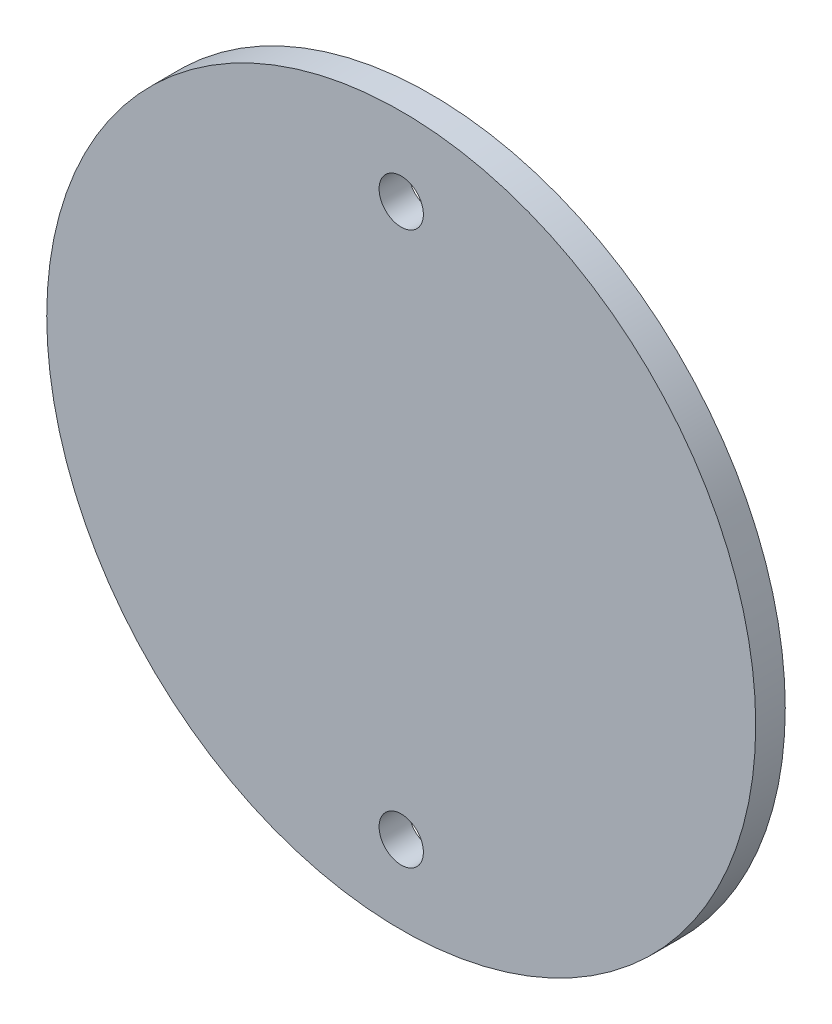
ISO-10303-21;
HEADER;
FILE_DESCRIPTION(('STEP AP214'),'2;1');
FILE_NAME('part.step','',(''),(''),'','','');
FILE_SCHEMA(('AUTOMOTIVE_DESIGN { 1 0 10303 214 1 1 1 1 }'));
ENDSEC;
DATA;
#1=APPLICATION_CONTEXT('core data for automotive mechanical design processes');
#2=APPLICATION_PROTOCOL_DEFINITION('international standard','automotive_design',2000,#1);
#3=PRODUCT_CONTEXT('',#1,'mechanical');
#4=PRODUCT('Part','Part','',(#3));
#5=PRODUCT_RELATED_PRODUCT_CATEGORY('part','',(#4));
#6=PRODUCT_DEFINITION_FORMATION('','',#4);
#7=PRODUCT_DEFINITION_CONTEXT('part definition',#1,'design');
#8=PRODUCT_DEFINITION('design','',#6,#7);
#9=PRODUCT_DEFINITION_SHAPE('','',#8);
#10=(LENGTH_UNIT() NAMED_UNIT(*) SI_UNIT(.MILLI.,.METRE.));
#11=(NAMED_UNIT(*) PLANE_ANGLE_UNIT() SI_UNIT($,.RADIAN.));
#12=(NAMED_UNIT(*) SI_UNIT($,.STERADIAN.) SOLID_ANGLE_UNIT());
#13=UNCERTAINTY_MEASURE_WITH_UNIT(LENGTH_MEASURE(1.E-05),#10,'distance_accuracy_value','');
#14=(GEOMETRIC_REPRESENTATION_CONTEXT(3) GLOBAL_UNCERTAINTY_ASSIGNED_CONTEXT((#13)) GLOBAL_UNIT_ASSIGNED_CONTEXT((#10,
#11,#12)) REPRESENTATION_CONTEXT('',''));
#15=CARTESIAN_POINT('',(0.,0.,0.));
#16=DIRECTION('',(0.,0.,1.));
#17=DIRECTION('',(1.,0.,0.));
#18=AXIS2_PLACEMENT_3D('',#15,#16,#17);
#19=CARTESIAN_POINT('',(0.,0.,6.35));
#20=DIRECTION('',(0.,0.,1.));
#21=DIRECTION('',(1.,0.,0.));
#22=AXIS2_PLACEMENT_3D('',#19,#20,#21);
#23=PLANE('',#22);
#24=CARTESIAN_POINT('',(0.,59.3725,6.35));
#25=DIRECTION('',(0.,0.,1.));
#26=DIRECTION('',(1.,0.,0.));
#27=AXIS2_PLACEMENT_3D('',#24,#25,#26);
#28=CIRCLE('',#27,4.7625);
#29=CARTESIAN_POINT('',(4.76250000000001,59.3725,6.35));
#30=VERTEX_POINT('',#29);
#31=EDGE_CURVE('E56',#30,#30,#28,.T.);
#32=ORIENTED_EDGE('',*,*,#31,.F.);
#33=EDGE_LOOP('',(#32));
#34=FACE_BOUND('',#33,.T.);
#35=CARTESIAN_POINT('',(0.,0.,6.35));
#36=DIRECTION('',(0.,0.,1.));
#37=DIRECTION('',(1.,0.,0.));
#38=AXIS2_PLACEMENT_3D('',#35,#36,#37);
#39=CIRCLE('',#38,76.2);
#40=CARTESIAN_POINT('',(76.2,0.,6.35));
#41=VERTEX_POINT('',#40);
#42=EDGE_CURVE('E10',#41,#41,#39,.T.);
#43=ORIENTED_EDGE('',*,*,#42,.T.);
#44=EDGE_LOOP('',(#43));
#45=FACE_BOUND('',#44,.T.);
#46=CARTESIAN_POINT('',(0.,-59.3725,6.35));
#47=DIRECTION('',(0.,0.,1.));
#48=DIRECTION('',(1.,0.,0.));
#49=AXIS2_PLACEMENT_3D('',#46,#47,#48);
#50=CIRCLE('',#49,4.7625);
#51=CARTESIAN_POINT('',(4.76250000000001,-59.3725,6.35));
#52=VERTEX_POINT('',#51);
#53=EDGE_CURVE('E62',#52,#52,#50,.T.);
#54=ORIENTED_EDGE('',*,*,#53,.F.);
#55=EDGE_LOOP('',(#54));
#56=FACE_BOUND('',#55,.T.);
#57=ADVANCED_FACE('F43',(#34,#45,#56),#23,.T.);
#58=CARTESIAN_POINT('',(0.,0.,0.));
#59=DIRECTION('',(0.,0.,1.));
#60=DIRECTION('',(1.,0.,0.));
#61=AXIS2_PLACEMENT_3D('',#58,#59,#60);
#62=PLANE('',#61);
#63=CARTESIAN_POINT('',(0.,0.,0.));
#64=DIRECTION('',(0.,0.,1.));
#65=DIRECTION('',(1.,0.,0.));
#66=AXIS2_PLACEMENT_3D('',#63,#64,#65);
#67=CIRCLE('',#66,76.2);
#68=CARTESIAN_POINT('',(76.2,0.,0.));
#69=VERTEX_POINT('',#68);
#70=EDGE_CURVE('E47',#69,#69,#67,.T.);
#71=ORIENTED_EDGE('',*,*,#70,.F.);
#72=EDGE_LOOP('',(#71));
#73=FACE_BOUND('',#72,.T.);
#74=CARTESIAN_POINT('',(0.,59.3725,0.));
#75=DIRECTION('',(0.,0.,1.));
#76=DIRECTION('',(1.,0.,0.));
#77=AXIS2_PLACEMENT_3D('',#74,#75,#76);
#78=CIRCLE('',#77,4.7625);
#79=CARTESIAN_POINT('',(4.76250000000001,59.3725,0.));
#80=VERTEX_POINT('',#79);
#81=EDGE_CURVE('E58',#80,#80,#78,.T.);
#82=ORIENTED_EDGE('',*,*,#81,.T.);
#83=EDGE_LOOP('',(#82));
#84=FACE_BOUND('',#83,.T.);
#85=CARTESIAN_POINT('',(0.,-59.3725,0.));
#86=DIRECTION('',(0.,0.,1.));
#87=DIRECTION('',(1.,0.,0.));
#88=AXIS2_PLACEMENT_3D('',#85,#86,#87);
#89=CIRCLE('',#88,4.7625);
#90=CARTESIAN_POINT('',(4.76250000000001,-59.3725,0.));
#91=VERTEX_POINT('',#90);
#92=EDGE_CURVE('E66',#91,#91,#89,.T.);
#93=ORIENTED_EDGE('',*,*,#92,.T.);
#94=EDGE_LOOP('',(#93));
#95=FACE_BOUND('',#94,.T.);
#96=ADVANCED_FACE('F78',(#73,#84,#95),#62,.F.);
#97=CARTESIAN_POINT('',(0.,0.,6.35));
#98=DIRECTION('',(0.,0.,-1.));
#99=DIRECTION('',(-1.,0.,0.));
#100=AXIS2_PLACEMENT_3D('',#97,#98,#99);
#101=CYLINDRICAL_SURFACE('',#100,76.2);
#102=ORIENTED_EDGE('',*,*,#42,.F.);
#103=EDGE_LOOP('',(#102));
#104=FACE_BOUND('',#103,.T.);
#105=ORIENTED_EDGE('',*,*,#70,.T.);
#106=EDGE_LOOP('',(#105));
#107=FACE_BOUND('',#106,.T.);
#108=ADVANCED_FACE('F45',(#104,#107),#101,.T.);
#109=CARTESIAN_POINT('',(0.,59.3725,6.35));
#110=DIRECTION('',(0.,0.,-1.));
#111=DIRECTION('',(-1.,0.,0.));
#112=AXIS2_PLACEMENT_3D('',#109,#110,#111);
#113=CYLINDRICAL_SURFACE('',#112,4.7625);
#114=ORIENTED_EDGE('',*,*,#31,.T.);
#115=EDGE_LOOP('',(#114));
#116=FACE_BOUND('',#115,.T.);
#117=ORIENTED_EDGE('',*,*,#81,.F.);
#118=EDGE_LOOP('',(#117));
#119=FACE_BOUND('',#118,.T.);
#120=ADVANCED_FACE('F87',(#116,#119),#113,.F.);
#121=CARTESIAN_POINT('',(0.,-59.3725,6.35));
#122=DIRECTION('',(0.,0.,-1.));
#123=DIRECTION('',(-1.,0.,0.));
#124=AXIS2_PLACEMENT_3D('',#121,#122,#123);
#125=CYLINDRICAL_SURFACE('',#124,4.7625);
#126=ORIENTED_EDGE('',*,*,#53,.T.);
#127=EDGE_LOOP('',(#126));
#128=FACE_BOUND('',#127,.T.);
#129=ORIENTED_EDGE('',*,*,#92,.F.);
#130=EDGE_LOOP('',(#129));
#131=FACE_BOUND('',#130,.T.);
#132=ADVANCED_FACE('F74',(#128,#131),#125,.F.);
#133=CLOSED_SHELL('',(#57,#96,#108,#120,#132));
#134=MANIFOLD_SOLID_BREP('B2',#133);
#135=ADVANCED_BREP_SHAPE_REPRESENTATION('',(#18,#134),#14);
#136=SHAPE_DEFINITION_REPRESENTATION(#9,#135);
ENDSEC;
END-ISO-10303-21;
